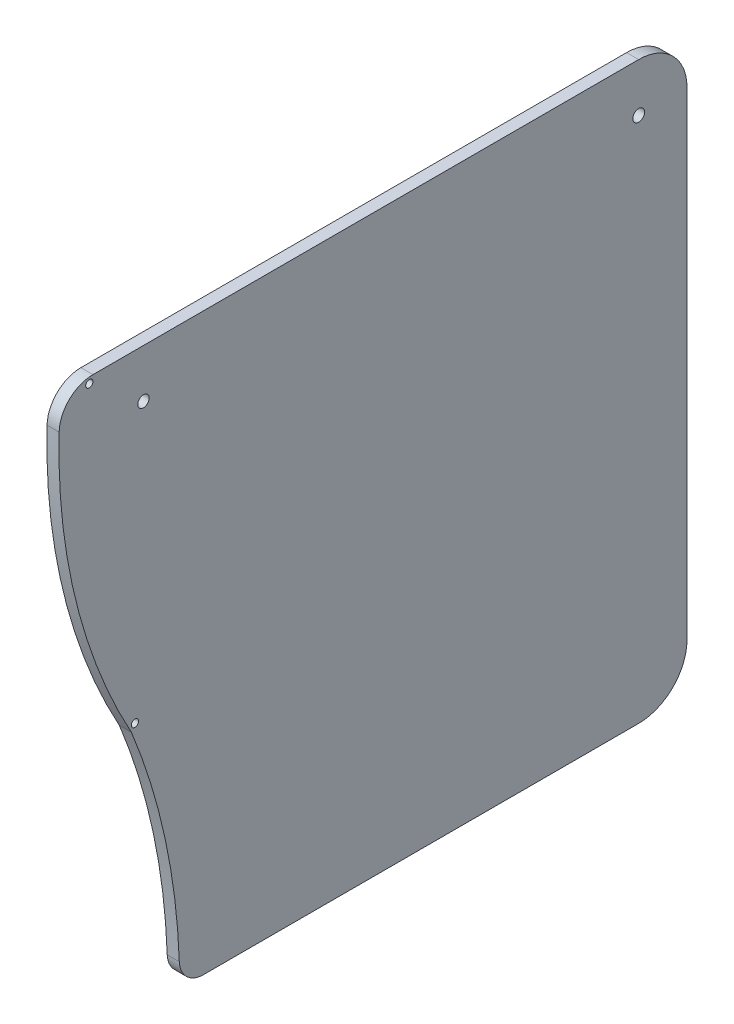
ISO-10303-21;
HEADER;
FILE_DESCRIPTION(('STEP AP214'),'2;1');
FILE_NAME('part.step','',(''),(''),'','','');
FILE_SCHEMA(('AUTOMOTIVE_DESIGN { 1 0 10303 214 1 1 1 1 }'));
ENDSEC;
DATA;
#1=APPLICATION_CONTEXT('core data for automotive mechanical design processes');
#2=APPLICATION_PROTOCOL_DEFINITION('international standard','automotive_design',2000,#1);
#3=PRODUCT_CONTEXT('',#1,'mechanical');
#4=PRODUCT('Part','Part','',(#3));
#5=PRODUCT_RELATED_PRODUCT_CATEGORY('part','',(#4));
#6=PRODUCT_DEFINITION_FORMATION('','',#4);
#7=PRODUCT_DEFINITION_CONTEXT('part definition',#1,'design');
#8=PRODUCT_DEFINITION('design','',#6,#7);
#9=PRODUCT_DEFINITION_SHAPE('','',#8);
#10=(LENGTH_UNIT() NAMED_UNIT(*) SI_UNIT(.MILLI.,.METRE.));
#11=(NAMED_UNIT(*) PLANE_ANGLE_UNIT() SI_UNIT($,.RADIAN.));
#12=(NAMED_UNIT(*) SI_UNIT($,.STERADIAN.) SOLID_ANGLE_UNIT());
#13=UNCERTAINTY_MEASURE_WITH_UNIT(LENGTH_MEASURE(1.E-05),#10,'distance_accuracy_value','');
#14=(GEOMETRIC_REPRESENTATION_CONTEXT(3) GLOBAL_UNCERTAINTY_ASSIGNED_CONTEXT((#13)) GLOBAL_UNIT_ASSIGNED_CONTEXT((#10,
#11,#12)) REPRESENTATION_CONTEXT('',''));
#15=CARTESIAN_POINT('',(0.,0.,0.));
#16=DIRECTION('',(0.,0.,1.));
#17=DIRECTION('',(1.,0.,0.));
#18=AXIS2_PLACEMENT_3D('',#15,#16,#17);
#19=CARTESIAN_POINT('',(3.175,0.,0.));
#20=DIRECTION('',(1.,0.,0.));
#21=DIRECTION('',(0.,0.,-1.));
#22=AXIS2_PLACEMENT_3D('',#19,#20,#21);
#23=PLANE('',#22);
#24=CARTESIAN_POINT('',(3.175,73.9775,74.5619158638602));
#25=DIRECTION('',(1.,0.,0.));
#26=DIRECTION('',(0.,0.,-1.));
#27=AXIS2_PLACEMENT_3D('',#24,#25,#26);
#28=CIRCLE('',#27,0.952499999999996);
#29=CARTESIAN_POINT('',(3.175,73.9775,73.6094158638602));
#30=VERTEX_POINT('',#29);
#31=EDGE_CURVE('E289',#30,#30,#28,.T.);
#32=ORIENTED_EDGE('',*,*,#31,.F.);
#33=EDGE_LOOP('',(#32));
#34=FACE_BOUND('',#33,.T.);
#35=CARTESIAN_POINT('',(3.175,-9.31335011248837,62.5720645796578));
#36=DIRECTION('',(1.,0.,0.));
#37=DIRECTION('',(0.,0.,-1.));
#38=AXIS2_PLACEMENT_3D('',#35,#36,#37);
#39=CIRCLE('',#38,0.952499999999996);
#40=CARTESIAN_POINT('',(3.175,-9.31335011248837,61.6195645796578));
#41=VERTEX_POINT('',#40);
#42=EDGE_CURVE('E281',#41,#41,#39,.T.);
#43=ORIENTED_EDGE('',*,*,#42,.F.);
#44=EDGE_LOOP('',(#43));
#45=FACE_BOUND('',#44,.T.);
#46=CARTESIAN_POINT('',(3.175,62.865,60.325));
#47=DIRECTION('',(1.,0.,0.));
#48=DIRECTION('',(0.,0.,-1.));
#49=AXIS2_PLACEMENT_3D('',#46,#47,#48);
#50=CIRCLE('',#49,1.5);
#51=CARTESIAN_POINT('',(3.175,62.865,58.825));
#52=VERTEX_POINT('',#51);
#53=EDGE_CURVE('E271',#52,#52,#50,.T.);
#54=ORIENTED_EDGE('',*,*,#53,.F.);
#55=EDGE_LOOP('',(#54));
#56=FACE_BOUND('',#55,.T.);
#57=CARTESIAN_POINT('',(3.175,62.865,-69.85));
#58=DIRECTION('',(1.,0.,0.));
#59=DIRECTION('',(0.,0.,-1.));
#60=AXIS2_PLACEMENT_3D('',#57,#58,#59);
#61=CIRCLE('',#60,1.54999999999999);
#62=CARTESIAN_POINT('',(3.175,62.865,-71.4));
#63=VERTEX_POINT('',#62);
#64=EDGE_CURVE('E166',#63,#63,#61,.T.);
#65=ORIENTED_EDGE('',*,*,#64,.F.);
#66=EDGE_LOOP('',(#65));
#67=FACE_BOUND('',#66,.T.);
#68=CARTESIAN_POINT('',(3.175,-75.565,221.70037307676));
#69=DIRECTION('',(1.,0.,0.));
#70=DIRECTION('',(0.,0.,-1.));
#71=AXIS2_PLACEMENT_3D('',#68,#69,#70);
#72=CIRCLE('',#71,170.90037307676);
#73=CARTESIAN_POINT('',(3.175,-69.4424889429008,50.909704783286));
#74=VERTEX_POINT('',#73);
#75=CARTESIAN_POINT('',(3.175,-10.9153327452514,63.5));
#76=VERTEX_POINT('',#75);
#77=EDGE_CURVE('E145',#74,#76,#72,.T.);
#78=ORIENTED_EDGE('',*,*,#77,.F.);
#79=CARTESIAN_POINT('',(3.175,-69.215,44.5637809907355));
#80=DIRECTION('',(1.,0.,0.));
#81=DIRECTION('',(0.,0.,-1.));
#82=AXIS2_PLACEMENT_3D('',#79,#80,#81);
#83=CIRCLE('',#82,6.35);
#84=CARTESIAN_POINT('',(3.175,-75.565,44.5637809907355));
#85=VERTEX_POINT('',#84);
#86=EDGE_CURVE('E86',#74,#85,#83,.T.);
#87=ORIENTED_EDGE('',*,*,#86,.T.);
#88=DIRECTION('',(0.,0.,-1.));
#89=VECTOR('',#88,1.);
#90=CARTESIAN_POINT('',(3.175,-75.565,0.));
#91=LINE('',#90,#89);
#92=CARTESIAN_POINT('',(3.175,-75.565,-69.8500000000001));
#93=VERTEX_POINT('',#92);
#94=EDGE_CURVE('E178',#85,#93,#91,.T.);
#95=ORIENTED_EDGE('',*,*,#94,.T.);
#96=CARTESIAN_POINT('',(3.175,-62.865,-69.8500000000001));
#97=DIRECTION('',(1.,0.,0.));
#98=DIRECTION('',(0.,0.,-1.));
#99=AXIS2_PLACEMENT_3D('',#96,#97,#98);
#100=CIRCLE('',#99,12.7);
#101=CARTESIAN_POINT('',(3.175,-62.865,-82.55));
#102=VERTEX_POINT('',#101);
#103=EDGE_CURVE('E181',#93,#102,#100,.T.);
#104=ORIENTED_EDGE('',*,*,#103,.T.);
#105=DIRECTION('',(0.,-1.,0.));
#106=VECTOR('',#105,1.);
#107=CARTESIAN_POINT('',(3.175,0.,-82.55));
#108=LINE('',#107,#106);
#109=CARTESIAN_POINT('',(3.175,62.865,-82.55));
#110=VERTEX_POINT('',#109);
#111=EDGE_CURVE('E184',#110,#102,#108,.T.);
#112=ORIENTED_EDGE('',*,*,#111,.F.);
#113=CARTESIAN_POINT('',(3.175,62.865,-69.85));
#114=DIRECTION('',(1.,0.,0.));
#115=DIRECTION('',(0.,0.,-1.));
#116=AXIS2_PLACEMENT_3D('',#113,#114,#115);
#117=CIRCLE('',#116,12.7);
#118=CARTESIAN_POINT('',(3.175,75.565,-69.85));
#119=VERTEX_POINT('',#118);
#120=EDGE_CURVE('E170',#110,#119,#117,.T.);
#121=ORIENTED_EDGE('',*,*,#120,.T.);
#122=DIRECTION('',(0.,0.,-1.));
#123=VECTOR('',#122,1.);
#124=CARTESIAN_POINT('',(3.175,75.565,0.));
#125=LINE('',#124,#123);
#126=CARTESIAN_POINT('',(3.175,75.565,73.6094158638603));
#127=VERTEX_POINT('',#126);
#128=EDGE_CURVE('E175',#127,#119,#125,.T.);
#129=ORIENTED_EDGE('',*,*,#128,.F.);
#130=CARTESIAN_POINT('',(3.175,66.675,73.6094158638603));
#131=DIRECTION('',(1.,0.,0.));
#132=DIRECTION('',(0.,0.,-1.));
#133=AXIS2_PLACEMENT_3D('',#130,#131,#132);
#134=CIRCLE('',#133,8.89);
#135=CARTESIAN_POINT('',(3.175,66.911017699115,82.496282333303));
#136=VERTEX_POINT('',#135);
#137=EDGE_CURVE('E226',#127,#136,#134,.T.);
#138=ORIENTED_EDGE('',*,*,#137,.T.);
#139=CARTESIAN_POINT('',(3.175,62.865,-69.85));
#140=DIRECTION('',(1.,0.,0.));
#141=DIRECTION('',(0.,0.,-1.));
#142=AXIS2_PLACEMENT_3D('',#139,#140,#141);
#143=CIRCLE('',#142,152.4);
#144=EDGE_CURVE('E155',#136,#76,#143,.T.);
#145=ORIENTED_EDGE('',*,*,#144,.T.);
#146=EDGE_LOOP('',(#78,#87,#95,#104,#112,#121,#129,#138,#145));
#147=FACE_BOUND('',#146,.T.);
#148=ADVANCED_FACE('F63',(#34,#45,#56,#67,#147),#23,.T.);
#149=CARTESIAN_POINT('',(0.,0.,0.));
#150=DIRECTION('',(1.,0.,0.));
#151=DIRECTION('',(0.,0.,-1.));
#152=AXIS2_PLACEMENT_3D('',#149,#150,#151);
#153=PLANE('',#152);
#154=CARTESIAN_POINT('',(0.,73.9775,74.5619158638602));
#155=DIRECTION('',(1.,0.,0.));
#156=DIRECTION('',(0.,0.,-1.));
#157=AXIS2_PLACEMENT_3D('',#154,#155,#156);
#158=CIRCLE('',#157,0.952499999999996);
#159=CARTESIAN_POINT('',(0.,73.9775,73.6094158638602));
#160=VERTEX_POINT('',#159);
#161=EDGE_CURVE('E278',#160,#160,#158,.T.);
#162=ORIENTED_EDGE('',*,*,#161,.T.);
#163=EDGE_LOOP('',(#162));
#164=FACE_BOUND('',#163,.T.);
#165=CARTESIAN_POINT('',(0.,-9.31335011248837,62.5720645796578));
#166=DIRECTION('',(1.,0.,0.));
#167=DIRECTION('',(0.,0.,-1.));
#168=AXIS2_PLACEMENT_3D('',#165,#166,#167);
#169=CIRCLE('',#168,0.952499999999996);
#170=CARTESIAN_POINT('',(0.,-9.31335011248837,61.6195645796578));
#171=VERTEX_POINT('',#170);
#172=EDGE_CURVE('E285',#171,#171,#169,.T.);
#173=ORIENTED_EDGE('',*,*,#172,.T.);
#174=EDGE_LOOP('',(#173));
#175=FACE_BOUND('',#174,.T.);
#176=CARTESIAN_POINT('',(0.,62.865,60.325));
#177=DIRECTION('',(1.,0.,0.));
#178=DIRECTION('',(0.,0.,-1.));
#179=AXIS2_PLACEMENT_3D('',#176,#177,#178);
#180=CIRCLE('',#179,1.5);
#181=CARTESIAN_POINT('',(0.,62.865,58.825));
#182=VERTEX_POINT('',#181);
#183=EDGE_CURVE('E267',#182,#182,#180,.T.);
#184=ORIENTED_EDGE('',*,*,#183,.T.);
#185=EDGE_LOOP('',(#184));
#186=FACE_BOUND('',#185,.T.);
#187=CARTESIAN_POINT('',(0.,62.865,-69.85));
#188=DIRECTION('',(1.,0.,0.));
#189=DIRECTION('',(0.,0.,-1.));
#190=AXIS2_PLACEMENT_3D('',#187,#188,#189);
#191=CIRCLE('',#190,1.54999999999999);
#192=CARTESIAN_POINT('',(0.,62.865,-71.4));
#193=VERTEX_POINT('',#192);
#194=EDGE_CURVE('E154',#193,#193,#191,.T.);
#195=ORIENTED_EDGE('',*,*,#194,.T.);
#196=EDGE_LOOP('',(#195));
#197=FACE_BOUND('',#196,.T.);
#198=DIRECTION('',(0.,0.,-1.));
#199=VECTOR('',#198,1.);
#200=CARTESIAN_POINT('',(0.,-75.565,0.));
#201=LINE('',#200,#199);
#202=CARTESIAN_POINT('',(0.,-75.565,44.5637809907355));
#203=VERTEX_POINT('',#202);
#204=CARTESIAN_POINT('',(0.,-75.565,-69.8500000000001));
#205=VERTEX_POINT('',#204);
#206=EDGE_CURVE('E199',#203,#205,#201,.T.);
#207=ORIENTED_EDGE('',*,*,#206,.F.);
#208=CARTESIAN_POINT('',(0.,-69.215,44.5637809907355));
#209=DIRECTION('',(1.,0.,0.));
#210=DIRECTION('',(0.,0.,-1.));
#211=AXIS2_PLACEMENT_3D('',#208,#209,#210);
#212=CIRCLE('',#211,6.35);
#213=CARTESIAN_POINT('',(0.,-69.4424889429008,50.909704783286));
#214=VERTEX_POINT('',#213);
#215=EDGE_CURVE('E12',#203,#214,#212,.F.);
#216=ORIENTED_EDGE('',*,*,#215,.T.);
#217=CARTESIAN_POINT('',(0.,-75.565,221.70037307676));
#218=DIRECTION('',(1.,0.,0.));
#219=DIRECTION('',(0.,0.,-1.));
#220=AXIS2_PLACEMENT_3D('',#217,#218,#219);
#221=CIRCLE('',#220,170.90037307676);
#222=CARTESIAN_POINT('',(0.,-10.9153327452514,63.5));
#223=VERTEX_POINT('',#222);
#224=EDGE_CURVE('E133',#214,#223,#221,.T.);
#225=ORIENTED_EDGE('',*,*,#224,.T.);
#226=CARTESIAN_POINT('',(0.,62.865,-69.85));
#227=DIRECTION('',(1.,0.,0.));
#228=DIRECTION('',(0.,0.,-1.));
#229=AXIS2_PLACEMENT_3D('',#226,#227,#228);
#230=CIRCLE('',#229,152.4);
#231=CARTESIAN_POINT('',(0.,66.911017699115,82.496282333303));
#232=VERTEX_POINT('',#231);
#233=EDGE_CURVE('E136',#232,#223,#230,.T.);
#234=ORIENTED_EDGE('',*,*,#233,.F.);
#235=CARTESIAN_POINT('',(0.,66.675,73.6094158638603));
#236=DIRECTION('',(1.,0.,0.));
#237=DIRECTION('',(0.,0.,-1.));
#238=AXIS2_PLACEMENT_3D('',#235,#236,#237);
#239=CIRCLE('',#238,8.89);
#240=CARTESIAN_POINT('',(0.,75.565,73.6094158638603));
#241=VERTEX_POINT('',#240);
#242=EDGE_CURVE('E231',#232,#241,#239,.F.);
#243=ORIENTED_EDGE('',*,*,#242,.T.);
#244=DIRECTION('',(0.,0.,-1.));
#245=VECTOR('',#244,1.);
#246=CARTESIAN_POINT('',(0.,75.565,0.));
#247=LINE('',#246,#245);
#248=CARTESIAN_POINT('',(0.,75.565,-69.85));
#249=VERTEX_POINT('',#248);
#250=EDGE_CURVE('E196',#241,#249,#247,.T.);
#251=ORIENTED_EDGE('',*,*,#250,.T.);
#252=CARTESIAN_POINT('',(0.,62.865,-69.85));
#253=DIRECTION('',(1.,0.,0.));
#254=DIRECTION('',(0.,0.,-1.));
#255=AXIS2_PLACEMENT_3D('',#252,#253,#254);
#256=CIRCLE('',#255,12.7);
#257=CARTESIAN_POINT('',(0.,62.865,-82.55));
#258=VERTEX_POINT('',#257);
#259=EDGE_CURVE('E192',#258,#249,#256,.T.);
#260=ORIENTED_EDGE('',*,*,#259,.F.);
#261=DIRECTION('',(0.,-1.,0.));
#262=VECTOR('',#261,1.);
#263=CARTESIAN_POINT('',(0.,0.,-82.55));
#264=LINE('',#263,#262);
#265=CARTESIAN_POINT('',(0.,-62.865,-82.55));
#266=VERTEX_POINT('',#265);
#267=EDGE_CURVE('E171',#258,#266,#264,.T.);
#268=ORIENTED_EDGE('',*,*,#267,.T.);
#269=CARTESIAN_POINT('',(0.,-62.865,-69.8500000000001));
#270=DIRECTION('',(1.,0.,0.));
#271=DIRECTION('',(0.,0.,-1.));
#272=AXIS2_PLACEMENT_3D('',#269,#270,#271);
#273=CIRCLE('',#272,12.7);
#274=EDGE_CURVE('E202',#205,#266,#273,.T.);
#275=ORIENTED_EDGE('',*,*,#274,.F.);
#276=EDGE_LOOP('',(#207,#216,#225,#234,#243,#251,#260,#268,#275));
#277=FACE_BOUND('',#276,.T.);
#278=ADVANCED_FACE('F135',(#164,#175,#186,#197,#277),#153,.F.);
#279=CARTESIAN_POINT('',(3.175,75.565,0.));
#280=DIRECTION('',(0.,1.,0.));
#281=DIRECTION('',(0.,0.,1.));
#282=AXIS2_PLACEMENT_3D('',#279,#280,#281);
#283=PLANE('',#282);
#284=ORIENTED_EDGE('',*,*,#250,.F.);
#285=DIRECTION('',(1.,0.,0.));
#286=VECTOR('',#285,1.);
#287=CARTESIAN_POINT('',(3.175,75.565,73.6094158638603));
#288=LINE('',#287,#286);
#289=EDGE_CURVE('E222',#241,#127,#288,.T.);
#290=ORIENTED_EDGE('',*,*,#289,.T.);
#291=ORIENTED_EDGE('',*,*,#128,.T.);
#292=DIRECTION('',(-1.,0.,0.));
#293=VECTOR('',#292,1.);
#294=CARTESIAN_POINT('',(3.175,75.565,-69.85));
#295=LINE('',#294,#293);
#296=EDGE_CURVE('E218',#119,#249,#295,.T.);
#297=ORIENTED_EDGE('',*,*,#296,.T.);
#298=EDGE_LOOP('',(#284,#290,#291,#297));
#299=FACE_BOUND('',#298,.T.);
#300=ADVANCED_FACE('F325',(#299),#283,.T.);
#301=CARTESIAN_POINT('',(3.175,62.865,-69.85));
#302=DIRECTION('',(-1.,0.,0.));
#303=DIRECTION('',(0.,0.,1.));
#304=AXIS2_PLACEMENT_3D('',#301,#302,#303);
#305=CYLINDRICAL_SURFACE('',#304,12.7);
#306=ORIENTED_EDGE('',*,*,#259,.T.);
#307=ORIENTED_EDGE('',*,*,#296,.F.);
#308=ORIENTED_EDGE('',*,*,#120,.F.);
#309=DIRECTION('',(-1.,0.,0.));
#310=VECTOR('',#309,1.);
#311=CARTESIAN_POINT('',(3.175,62.865,-82.55));
#312=LINE('',#311,#310);
#313=EDGE_CURVE('E188',#110,#258,#312,.T.);
#314=ORIENTED_EDGE('',*,*,#313,.T.);
#315=EDGE_LOOP('',(#306,#307,#308,#314));
#316=FACE_BOUND('',#315,.T.);
#317=ADVANCED_FACE('F330',(#316),#305,.T.);
#318=CARTESIAN_POINT('',(3.175,-75.565,0.));
#319=DIRECTION('',(0.,1.,0.));
#320=DIRECTION('',(0.,0.,1.));
#321=AXIS2_PLACEMENT_3D('',#318,#319,#320);
#322=PLANE('',#321);
#323=ORIENTED_EDGE('',*,*,#94,.F.);
#324=DIRECTION('',(1.,0.,0.));
#325=VECTOR('',#324,1.);
#326=CARTESIAN_POINT('',(3.175,-75.565,44.5637809907355));
#327=LINE('',#326,#325);
#328=EDGE_CURVE('E72',#85,#203,#327,.F.);
#329=ORIENTED_EDGE('',*,*,#328,.T.);
#330=ORIENTED_EDGE('',*,*,#206,.T.);
#331=DIRECTION('',(-1.,0.,0.));
#332=VECTOR('',#331,1.);
#333=CARTESIAN_POINT('',(3.175,-75.565,-69.8500000000001));
#334=LINE('',#333,#332);
#335=EDGE_CURVE('E214',#93,#205,#334,.T.);
#336=ORIENTED_EDGE('',*,*,#335,.F.);
#337=EDGE_LOOP('',(#323,#329,#330,#336));
#338=FACE_BOUND('',#337,.T.);
#339=ADVANCED_FACE('F340',(#338),#322,.F.);
#340=CARTESIAN_POINT('',(3.175,-62.865,-69.8500000000001));
#341=DIRECTION('',(-1.,0.,0.));
#342=DIRECTION('',(0.,0.,1.));
#343=AXIS2_PLACEMENT_3D('',#340,#341,#342);
#344=CYLINDRICAL_SURFACE('',#343,12.7);
#345=ORIENTED_EDGE('',*,*,#274,.T.);
#346=DIRECTION('',(-1.,0.,0.));
#347=VECTOR('',#346,1.);
#348=CARTESIAN_POINT('',(3.175,-62.865,-82.55));
#349=LINE('',#348,#347);
#350=EDGE_CURVE('E211',#102,#266,#349,.T.);
#351=ORIENTED_EDGE('',*,*,#350,.F.);
#352=ORIENTED_EDGE('',*,*,#103,.F.);
#353=ORIENTED_EDGE('',*,*,#335,.T.);
#354=EDGE_LOOP('',(#345,#351,#352,#353));
#355=FACE_BOUND('',#354,.T.);
#356=ADVANCED_FACE('F320',(#355),#344,.T.);
#357=CARTESIAN_POINT('',(3.175,62.865,-69.85));
#358=DIRECTION('',(-1.,0.,0.));
#359=DIRECTION('',(0.,0.,1.));
#360=AXIS2_PLACEMENT_3D('',#357,#358,#359);
#361=CYLINDRICAL_SURFACE('',#360,1.54999999999999);
#362=ORIENTED_EDGE('',*,*,#64,.T.);
#363=EDGE_LOOP('',(#362));
#364=FACE_BOUND('',#363,.T.);
#365=ORIENTED_EDGE('',*,*,#194,.F.);
#366=EDGE_LOOP('',(#365));
#367=FACE_BOUND('',#366,.T.);
#368=ADVANCED_FACE('F316',(#364,#367),#361,.F.);
#369=CARTESIAN_POINT('',(3.175,0.,-82.55));
#370=DIRECTION('',(0.,0.,-1.));
#371=DIRECTION('',(-1.,0.,0.));
#372=AXIS2_PLACEMENT_3D('',#369,#370,#371);
#373=PLANE('',#372);
#374=ORIENTED_EDGE('',*,*,#267,.F.);
#375=ORIENTED_EDGE('',*,*,#313,.F.);
#376=ORIENTED_EDGE('',*,*,#111,.T.);
#377=ORIENTED_EDGE('',*,*,#350,.T.);
#378=EDGE_LOOP('',(#374,#375,#376,#377));
#379=FACE_BOUND('',#378,.T.);
#380=ADVANCED_FACE('F319',(#379),#373,.T.);
#381=CARTESIAN_POINT('',(0.,62.865,-69.85));
#382=DIRECTION('',(1.,0.,0.));
#383=DIRECTION('',(0.,0.,-1.));
#384=AXIS2_PLACEMENT_3D('',#381,#382,#383);
#385=CYLINDRICAL_SURFACE('',#384,152.4);
#386=ORIENTED_EDGE('',*,*,#144,.F.);
#387=DIRECTION('',(1.,0.,0.));
#388=VECTOR('',#387,1.);
#389=CARTESIAN_POINT('',(0.,66.911017699115,82.496282333303));
#390=LINE('',#389,#388);
#391=EDGE_CURVE('E152',#136,#232,#390,.F.);
#392=ORIENTED_EDGE('',*,*,#391,.T.);
#393=ORIENTED_EDGE('',*,*,#233,.T.);
#394=DIRECTION('',(1.,0.,0.));
#395=VECTOR('',#394,1.);
#396=CARTESIAN_POINT('',(0.,-10.9153327452514,63.5));
#397=LINE('',#396,#395);
#398=EDGE_CURVE('E144',#223,#76,#397,.T.);
#399=ORIENTED_EDGE('',*,*,#398,.T.);
#400=EDGE_LOOP('',(#386,#392,#393,#399));
#401=FACE_BOUND('',#400,.T.);
#402=ADVANCED_FACE('F150',(#401),#385,.T.);
#403=CARTESIAN_POINT('',(0.,-75.565,221.70037307676));
#404=DIRECTION('',(1.,0.,0.));
#405=DIRECTION('',(0.,0.,-1.));
#406=AXIS2_PLACEMENT_3D('',#403,#404,#405);
#407=CYLINDRICAL_SURFACE('',#406,170.90037307676);
#408=ORIENTED_EDGE('',*,*,#224,.F.);
#409=DIRECTION('',(1.,0.,0.));
#410=VECTOR('',#409,1.);
#411=CARTESIAN_POINT('',(0.,-69.4424889429008,50.909704783286));
#412=LINE('',#411,#410);
#413=EDGE_CURVE('E234',#214,#74,#412,.T.);
#414=ORIENTED_EDGE('',*,*,#413,.T.);
#415=ORIENTED_EDGE('',*,*,#77,.T.);
#416=ORIENTED_EDGE('',*,*,#398,.F.);
#417=EDGE_LOOP('',(#408,#414,#415,#416));
#418=FACE_BOUND('',#417,.T.);
#419=ADVANCED_FACE('F157',(#418),#407,.F.);
#420=CARTESIAN_POINT('',(0.,66.675,73.6094158638603));
#421=DIRECTION('',(1.,0.,0.));
#422=DIRECTION('',(0.,0.,-1.));
#423=AXIS2_PLACEMENT_3D('',#420,#421,#422);
#424=CYLINDRICAL_SURFACE('',#423,8.89);
#425=ORIENTED_EDGE('',*,*,#242,.F.);
#426=ORIENTED_EDGE('',*,*,#391,.F.);
#427=ORIENTED_EDGE('',*,*,#137,.F.);
#428=ORIENTED_EDGE('',*,*,#289,.F.);
#429=EDGE_LOOP('',(#425,#426,#427,#428));
#430=FACE_BOUND('',#429,.T.);
#431=ADVANCED_FACE('F346',(#430),#424,.T.);
#432=CARTESIAN_POINT('',(0.,62.865,60.325));
#433=DIRECTION('',(1.,0.,0.));
#434=DIRECTION('',(0.,0.,-1.));
#435=AXIS2_PLACEMENT_3D('',#432,#433,#434);
#436=CYLINDRICAL_SURFACE('',#435,1.5);
#437=ORIENTED_EDGE('',*,*,#183,.F.);
#438=EDGE_LOOP('',(#437));
#439=FACE_BOUND('',#438,.T.);
#440=ORIENTED_EDGE('',*,*,#53,.T.);
#441=EDGE_LOOP('',(#440));
#442=FACE_BOUND('',#441,.T.);
#443=ADVANCED_FACE('F348',(#439,#442),#436,.F.);
#444=CARTESIAN_POINT('',(0.,-9.31335011248837,62.5720645796578));
#445=DIRECTION('',(1.,0.,0.));
#446=DIRECTION('',(0.,0.,-1.));
#447=AXIS2_PLACEMENT_3D('',#444,#445,#446);
#448=CYLINDRICAL_SURFACE('',#447,0.952499999999996);
#449=ORIENTED_EDGE('',*,*,#172,.F.);
#450=EDGE_LOOP('',(#449));
#451=FACE_BOUND('',#450,.T.);
#452=ORIENTED_EDGE('',*,*,#42,.T.);
#453=EDGE_LOOP('',(#452));
#454=FACE_BOUND('',#453,.T.);
#455=ADVANCED_FACE('F303',(#451,#454),#448,.F.);
#456=CARTESIAN_POINT('',(0.,73.9775,74.5619158638602));
#457=DIRECTION('',(1.,0.,0.));
#458=DIRECTION('',(0.,0.,-1.));
#459=AXIS2_PLACEMENT_3D('',#456,#457,#458);
#460=CYLINDRICAL_SURFACE('',#459,0.952499999999996);
#461=ORIENTED_EDGE('',*,*,#161,.F.);
#462=EDGE_LOOP('',(#461));
#463=FACE_BOUND('',#462,.T.);
#464=ORIENTED_EDGE('',*,*,#31,.T.);
#465=EDGE_LOOP('',(#464));
#466=FACE_BOUND('',#465,.T.);
#467=ADVANCED_FACE('F300',(#463,#466),#460,.F.);
#468=CARTESIAN_POINT('',(0.,-69.215,44.5637809907355));
#469=DIRECTION('',(1.,0.,0.));
#470=DIRECTION('',(0.,0.,-1.));
#471=AXIS2_PLACEMENT_3D('',#468,#469,#470);
#472=CYLINDRICAL_SURFACE('',#471,6.35);
#473=ORIENTED_EDGE('',*,*,#215,.F.);
#474=ORIENTED_EDGE('',*,*,#328,.F.);
#475=ORIENTED_EDGE('',*,*,#86,.F.);
#476=ORIENTED_EDGE('',*,*,#413,.F.);
#477=EDGE_LOOP('',(#473,#474,#475,#476));
#478=FACE_BOUND('',#477,.T.);
#479=ADVANCED_FACE('F65',(#478),#472,.T.);
#480=CLOSED_SHELL('',(#148,#278,#300,#317,#339,#356,#368,#380,#402,#419,#431,#443,#455,#467,#479));
#481=MANIFOLD_SOLID_BREP('B2',#480);
#482=ADVANCED_BREP_SHAPE_REPRESENTATION('',(#18,#481),#14);
#483=SHAPE_DEFINITION_REPRESENTATION(#9,#482);
ENDSEC;
END-ISO-10303-21;
